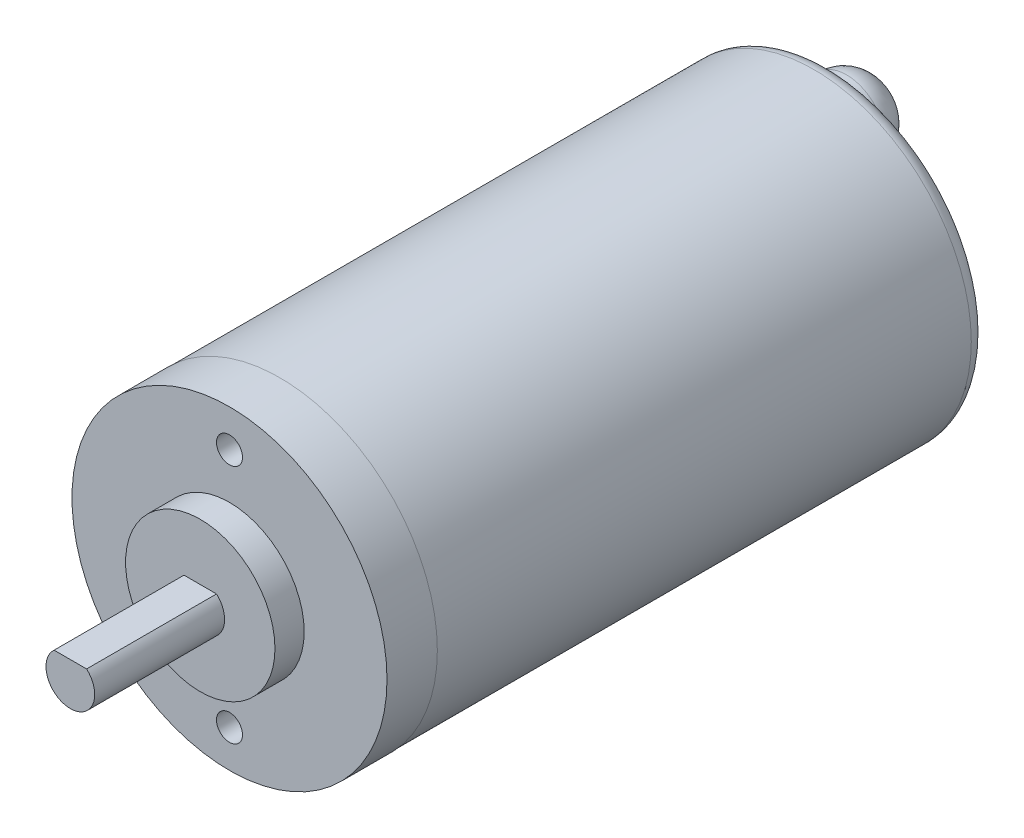
ISO-10303-21;
HEADER;
FILE_DESCRIPTION(('STEP AP214'),'2;1');
FILE_NAME('part.step','',(''),(''),'','','');
FILE_SCHEMA(('AUTOMOTIVE_DESIGN { 1 0 10303 214 1 1 1 1 }'));
ENDSEC;
DATA;
#1=APPLICATION_CONTEXT('core data for automotive mechanical design processes');
#2=APPLICATION_PROTOCOL_DEFINITION('international standard','automotive_design',2000,#1);
#3=PRODUCT_CONTEXT('',#1,'mechanical');
#4=PRODUCT('Part','Part','',(#3));
#5=PRODUCT_RELATED_PRODUCT_CATEGORY('part','',(#4));
#6=PRODUCT_DEFINITION_FORMATION('','',#4);
#7=PRODUCT_DEFINITION_CONTEXT('part definition',#1,'design');
#8=PRODUCT_DEFINITION('design','',#6,#7);
#9=PRODUCT_DEFINITION_SHAPE('','',#8);
#10=(LENGTH_UNIT() NAMED_UNIT(*) SI_UNIT(.MILLI.,.METRE.));
#11=(NAMED_UNIT(*) PLANE_ANGLE_UNIT() SI_UNIT($,.RADIAN.));
#12=(NAMED_UNIT(*) SI_UNIT($,.STERADIAN.) SOLID_ANGLE_UNIT());
#13=UNCERTAINTY_MEASURE_WITH_UNIT(LENGTH_MEASURE(1.E-05),#10,'distance_accuracy_value','');
#14=(GEOMETRIC_REPRESENTATION_CONTEXT(3) GLOBAL_UNCERTAINTY_ASSIGNED_CONTEXT((#13)) GLOBAL_UNIT_ASSIGNED_CONTEXT((#10,
#11,#12)) REPRESENTATION_CONTEXT('',''));
#15=CARTESIAN_POINT('',(0.,0.,0.));
#16=DIRECTION('',(0.,0.,1.));
#17=DIRECTION('',(1.,0.,0.));
#18=AXIS2_PLACEMENT_3D('',#15,#16,#17);
#19=CARTESIAN_POINT('',(0.,0.,-46.99));
#20=DIRECTION('',(0.,0.,1.));
#21=DIRECTION('',(1.,0.,0.));
#22=AXIS2_PLACEMENT_3D('',#19,#20,#21);
#23=CYLINDRICAL_SURFACE('',#22,12.319);
#24=CARTESIAN_POINT('',(0.,0.,-3.937));
#25=DIRECTION('',(0.,0.,-1.));
#26=DIRECTION('',(-1.,0.,0.));
#27=AXIS2_PLACEMENT_3D('',#24,#25,#26);
#28=CIRCLE('',#27,12.319);
#29=CARTESIAN_POINT('',(-12.319,0.,-3.937));
#30=VERTEX_POINT('',#29);
#31=EDGE_CURVE('E79',#30,#30,#28,.T.);
#32=ORIENTED_EDGE('',*,*,#31,.F.);
#33=EDGE_LOOP('',(#32));
#34=FACE_BOUND('',#33,.T.);
#35=CARTESIAN_POINT('',(0.,0.,0.));
#36=DIRECTION('',(0.,0.,1.));
#37=DIRECTION('',(1.,0.,0.));
#38=AXIS2_PLACEMENT_3D('',#35,#36,#37);
#39=CIRCLE('',#38,12.319);
#40=CARTESIAN_POINT('',(12.319,0.,0.));
#41=VERTEX_POINT('',#40);
#42=EDGE_CURVE('E85',#41,#41,#39,.T.);
#43=ORIENTED_EDGE('',*,*,#42,.F.);
#44=EDGE_LOOP('',(#43));
#45=FACE_BOUND('',#44,.T.);
#46=ADVANCED_FACE('F35',(#34,#45),#23,.T.);
#47=CARTESIAN_POINT('',(0.,0.,0.));
#48=DIRECTION('',(0.,0.,1.));
#49=DIRECTION('',(1.,0.,0.));
#50=AXIS2_PLACEMENT_3D('',#47,#48,#49);
#51=PLANE('',#50);
#52=CARTESIAN_POINT('',(0.,-9.398,0.));
#53=DIRECTION('',(0.,0.,-1.));
#54=DIRECTION('',(1.,0.,0.));
#55=AXIS2_PLACEMENT_3D('',#52,#53,#54);
#56=CIRCLE('',#55,1.016);
#57=CARTESIAN_POINT('',(1.016,-9.398,0.));
#58=VERTEX_POINT('',#57);
#59=EDGE_CURVE('E167',#58,#58,#56,.T.);
#60=ORIENTED_EDGE('',*,*,#59,.T.);
#61=EDGE_LOOP('',(#60));
#62=FACE_BOUND('',#61,.T.);
#63=CARTESIAN_POINT('',(0.,9.398,0.));
#64=DIRECTION('',(0.,0.,1.));
#65=DIRECTION('',(1.,0.,0.));
#66=AXIS2_PLACEMENT_3D('',#63,#64,#65);
#67=CIRCLE('',#66,1.016);
#68=CARTESIAN_POINT('',(1.016,9.398,0.));
#69=VERTEX_POINT('',#68);
#70=EDGE_CURVE('E161',#69,#69,#67,.T.);
#71=ORIENTED_EDGE('',*,*,#70,.F.);
#72=EDGE_LOOP('',(#71));
#73=FACE_BOUND('',#72,.T.);
#74=CARTESIAN_POINT('',(0.,0.,0.));
#75=DIRECTION('',(0.,0.,1.));
#76=DIRECTION('',(1.,0.,0.));
#77=AXIS2_PLACEMENT_3D('',#74,#75,#76);
#78=CIRCLE('',#77,5.842);
#79=CARTESIAN_POINT('',(5.842,0.,0.));
#80=VERTEX_POINT('',#79);
#81=EDGE_CURVE('E76',#80,#80,#78,.T.);
#82=ORIENTED_EDGE('',*,*,#81,.F.);
#83=EDGE_LOOP('',(#82));
#84=FACE_BOUND('',#83,.T.);
#85=ORIENTED_EDGE('',*,*,#42,.T.);
#86=EDGE_LOOP('',(#85));
#87=FACE_BOUND('',#86,.T.);
#88=ADVANCED_FACE('F122',(#62,#73,#84,#87),#51,.T.);
#89=CARTESIAN_POINT('',(0.,0.,2.286));
#90=DIRECTION('',(0.,0.,-1.));
#91=DIRECTION('',(-1.,0.,0.));
#92=AXIS2_PLACEMENT_3D('',#89,#90,#91);
#93=CYLINDRICAL_SURFACE('',#92,5.842);
#94=CARTESIAN_POINT('',(0.,0.,2.286));
#95=DIRECTION('',(0.,0.,1.));
#96=DIRECTION('',(1.,0.,0.));
#97=AXIS2_PLACEMENT_3D('',#94,#95,#96);
#98=CIRCLE('',#97,5.842);
#99=CARTESIAN_POINT('',(5.842,0.,2.286));
#100=VERTEX_POINT('',#99);
#101=EDGE_CURVE('E82',#100,#100,#98,.T.);
#102=ORIENTED_EDGE('',*,*,#101,.F.);
#103=EDGE_LOOP('',(#102));
#104=FACE_BOUND('',#103,.T.);
#105=ORIENTED_EDGE('',*,*,#81,.T.);
#106=EDGE_LOOP('',(#105));
#107=FACE_BOUND('',#106,.T.);
#108=ADVANCED_FACE('F128',(#104,#107),#93,.T.);
#109=CARTESIAN_POINT('',(0.,0.,2.286));
#110=DIRECTION('',(0.,0.,1.));
#111=DIRECTION('',(1.,0.,0.));
#112=AXIS2_PLACEMENT_3D('',#109,#110,#111);
#113=PLANE('',#112);
#114=CARTESIAN_POINT('',(0.,0.,2.286));
#115=DIRECTION('',(0.,0.,1.));
#116=DIRECTION('',(1.,0.,0.));
#117=AXIS2_PLACEMENT_3D('',#114,#115,#116);
#118=CIRCLE('',#117,1.905);
#119=CARTESIAN_POINT('',(-1.27205208190772,1.41806505524755,2.286));
#120=VERTEX_POINT('',#119);
#121=CARTESIAN_POINT('',(1.27205208190772,1.41806505524755,2.286));
#122=VERTEX_POINT('',#121);
#123=EDGE_CURVE('E70',#120,#122,#118,.T.);
#124=ORIENTED_EDGE('',*,*,#123,.F.);
#125=DIRECTION('',(-1.,0.,0.));
#126=VECTOR('',#125,1.);
#127=CARTESIAN_POINT('',(-1.49562694866086,1.41806505524755,2.286));
#128=LINE('',#127,#126);
#129=EDGE_CURVE('E60',#122,#120,#128,.T.);
#130=ORIENTED_EDGE('',*,*,#129,.F.);
#131=EDGE_LOOP('',(#124,#130));
#132=FACE_BOUND('',#131,.T.);
#133=ORIENTED_EDGE('',*,*,#101,.T.);
#134=EDGE_LOOP('',(#133));
#135=FACE_BOUND('',#134,.T.);
#136=ADVANCED_FACE('F68',(#132,#135),#113,.T.);
#137=CARTESIAN_POINT('',(0.,0.,12.446));
#138=DIRECTION('',(0.,0.,-1.));
#139=DIRECTION('',(-1.,0.,0.));
#140=AXIS2_PLACEMENT_3D('',#137,#138,#139);
#141=CYLINDRICAL_SURFACE('',#140,1.905);
#142=CARTESIAN_POINT('',(0.,0.,12.446));
#143=DIRECTION('',(0.,0.,1.));
#144=DIRECTION('',(1.,0.,0.));
#145=AXIS2_PLACEMENT_3D('',#142,#143,#144);
#146=CIRCLE('',#145,1.905);
#147=CARTESIAN_POINT('',(-1.27205208190772,1.41806505524755,12.446));
#148=VERTEX_POINT('',#147);
#149=CARTESIAN_POINT('',(1.27205208190772,1.41806505524755,12.446));
#150=VERTEX_POINT('',#149);
#151=EDGE_CURVE('E73',#148,#150,#146,.T.);
#152=ORIENTED_EDGE('',*,*,#151,.F.);
#153=DIRECTION('',(0.,0.,-1.));
#154=VECTOR('',#153,1.);
#155=CARTESIAN_POINT('',(-1.27205208190772,1.41806505524755,12.446));
#156=LINE('',#155,#154);
#157=EDGE_CURVE('E49',#148,#120,#156,.T.);
#158=ORIENTED_EDGE('',*,*,#157,.T.);
#159=ORIENTED_EDGE('',*,*,#123,.T.);
#160=DIRECTION('',(0.,0.,-1.));
#161=VECTOR('',#160,1.);
#162=CARTESIAN_POINT('',(1.27205208190772,1.41806505524755,12.446));
#163=LINE('',#162,#161);
#164=EDGE_CURVE('E57',#122,#150,#163,.F.);
#165=ORIENTED_EDGE('',*,*,#164,.T.);
#166=EDGE_LOOP('',(#152,#158,#159,#165));
#167=FACE_BOUND('',#166,.T.);
#168=ADVANCED_FACE('F72',(#167),#141,.T.);
#169=CARTESIAN_POINT('',(0.,0.,12.446));
#170=DIRECTION('',(0.,0.,1.));
#171=DIRECTION('',(1.,0.,0.));
#172=AXIS2_PLACEMENT_3D('',#169,#170,#171);
#173=PLANE('',#172);
#174=DIRECTION('',(1.,0.,0.));
#175=VECTOR('',#174,1.);
#176=CARTESIAN_POINT('',(0.,1.41806505524755,12.446));
#177=LINE('',#176,#175);
#178=EDGE_CURVE('E11',#148,#150,#177,.T.);
#179=ORIENTED_EDGE('',*,*,#178,.F.);
#180=ORIENTED_EDGE('',*,*,#151,.T.);
#181=EDGE_LOOP('',(#179,#180));
#182=FACE_BOUND('',#181,.T.);
#183=ADVANCED_FACE('F155',(#182),#173,.T.);
#184=CARTESIAN_POINT('',(0.,12.319,-3.937));
#185=DIRECTION('',(0.,0.,1.));
#186=DIRECTION('',(1.,0.,0.));
#187=AXIS2_PLACEMENT_3D('',#184,#185,#186);
#188=PLANE('',#187);
#189=CARTESIAN_POINT('',(0.,0.,-3.937));
#190=DIRECTION('',(0.,0.,-1.));
#191=DIRECTION('',(-1.,0.,0.));
#192=AXIS2_PLACEMENT_3D('',#189,#190,#191);
#193=CIRCLE('',#192,12.2936);
#194=CARTESIAN_POINT('',(-12.2936,0.,-3.937));
#195=VERTEX_POINT('',#194);
#196=EDGE_CURVE('E74',#195,#195,#193,.T.);
#197=ORIENTED_EDGE('',*,*,#196,.F.);
#198=EDGE_LOOP('',(#197));
#199=FACE_BOUND('',#198,.T.);
#200=ORIENTED_EDGE('',*,*,#31,.T.);
#201=EDGE_LOOP('',(#200));
#202=FACE_BOUND('',#201,.T.);
#203=ADVANCED_FACE('F149',(#199,#202),#188,.F.);
#204=CARTESIAN_POINT('',(0.,0.,-46.99));
#205=DIRECTION('',(0.,0.,-1.));
#206=DIRECTION('',(-1.,0.,0.));
#207=AXIS2_PLACEMENT_3D('',#204,#205,#206);
#208=CYLINDRICAL_SURFACE('',#207,12.2936);
#209=CARTESIAN_POINT('',(0.,0.,-45.72));
#210=DIRECTION('',(0.,0.,1.));
#211=DIRECTION('',(1.,0.,0.));
#212=AXIS2_PLACEMENT_3D('',#209,#210,#211);
#213=CIRCLE('',#212,12.2936);
#214=CARTESIAN_POINT('',(12.2936,0.,-45.72));
#215=VERTEX_POINT('',#214);
#216=EDGE_CURVE('E93',#215,#215,#213,.T.);
#217=ORIENTED_EDGE('',*,*,#216,.T.);
#218=EDGE_LOOP('',(#217));
#219=FACE_BOUND('',#218,.T.);
#220=ORIENTED_EDGE('',*,*,#196,.T.);
#221=EDGE_LOOP('',(#220));
#222=FACE_BOUND('',#221,.T.);
#223=ADVANCED_FACE('F140',(#219,#222),#208,.T.);
#224=CARTESIAN_POINT('',(0.,0.,-46.99));
#225=DIRECTION('',(0.,0.,1.));
#226=DIRECTION('',(1.,0.,0.));
#227=AXIS2_PLACEMENT_3D('',#224,#225,#226);
#228=PLANE('',#227);
#229=CARTESIAN_POINT('',(0.,7.62,-46.99));
#230=DIRECTION('',(0.,0.,1.));
#231=DIRECTION('',(1.,0.,0.));
#232=AXIS2_PLACEMENT_3D('',#229,#230,#231);
#233=CIRCLE('',#232,3.048);
#234=CARTESIAN_POINT('',(3.048,7.62,-46.99));
#235=VERTEX_POINT('',#234);
#236=EDGE_CURVE('E96',#235,#235,#233,.F.);
#237=ORIENTED_EDGE('',*,*,#236,.F.);
#238=EDGE_LOOP('',(#237));
#239=FACE_BOUND('',#238,.T.);
#240=CARTESIAN_POINT('',(0.,0.,-46.99));
#241=DIRECTION('',(0.,0.,1.));
#242=DIRECTION('',(1.,0.,0.));
#243=AXIS2_PLACEMENT_3D('',#240,#241,#242);
#244=CIRCLE('',#243,11.0236);
#245=CARTESIAN_POINT('',(11.0236,0.,-46.99));
#246=VERTEX_POINT('',#245);
#247=EDGE_CURVE('E90',#246,#246,#244,.F.);
#248=ORIENTED_EDGE('',*,*,#247,.T.);
#249=EDGE_LOOP('',(#248));
#250=FACE_BOUND('',#249,.T.);
#251=ADVANCED_FACE('F135',(#239,#250),#228,.F.);
#252=CARTESIAN_POINT('',(0.,0.,-45.72));
#253=DIRECTION('',(0.,0.,1.));
#254=DIRECTION('',(1.,0.,0.));
#255=AXIS2_PLACEMENT_3D('',#252,#253,#254);
#256=TOROIDAL_SURFACE('',#255,11.0236,1.27);
#257=ORIENTED_EDGE('',*,*,#216,.F.);
#258=EDGE_LOOP('',(#257));
#259=FACE_BOUND('',#258,.T.);
#260=ORIENTED_EDGE('',*,*,#247,.F.);
#261=EDGE_LOOP('',(#260));
#262=FACE_BOUND('',#261,.T.);
#263=ADVANCED_FACE('F118',(#259,#262),#256,.T.);
#264=CARTESIAN_POINT('',(0.,7.62,-50.8));
#265=DIRECTION('',(0.,0.,1.));
#266=DIRECTION('',(1.,0.,0.));
#267=AXIS2_PLACEMENT_3D('',#264,#265,#266);
#268=CYLINDRICAL_SURFACE('',#267,3.048);
#269=CARTESIAN_POINT('',(0.,7.62,-48.26));
#270=DIRECTION('',(0.,0.,-1.));
#271=DIRECTION('',(-1.,0.,0.));
#272=AXIS2_PLACEMENT_3D('',#269,#270,#271);
#273=CIRCLE('',#272,3.048);
#274=CARTESIAN_POINT('',(-3.048,7.62,-48.26));
#275=VERTEX_POINT('',#274);
#276=EDGE_CURVE('E43',#275,#275,#273,.F.);
#277=ORIENTED_EDGE('',*,*,#276,.T.);
#278=EDGE_LOOP('',(#277));
#279=FACE_BOUND('',#278,.T.);
#280=ORIENTED_EDGE('',*,*,#236,.T.);
#281=EDGE_LOOP('',(#280));
#282=FACE_BOUND('',#281,.T.);
#283=ADVANCED_FACE('F104',(#279,#282),#268,.T.);
#284=CARTESIAN_POINT('',(0.,7.62,-50.8));
#285=DIRECTION('',(0.,0.,-1.));
#286=DIRECTION('',(-1.,0.,0.));
#287=AXIS2_PLACEMENT_3D('',#284,#285,#286);
#288=PLANE('',#287);
#289=CARTESIAN_POINT('',(0.,7.62,-50.8));
#290=DIRECTION('',(0.,0.,-1.));
#291=DIRECTION('',(-1.,0.,0.));
#292=AXIS2_PLACEMENT_3D('',#289,#290,#291);
#293=CIRCLE('',#292,0.508);
#294=CARTESIAN_POINT('',(-0.508,7.62,-50.8));
#295=VERTEX_POINT('',#294);
#296=EDGE_CURVE('E99',#295,#295,#293,.T.);
#297=ORIENTED_EDGE('',*,*,#296,.T.);
#298=EDGE_LOOP('',(#297));
#299=FACE_BOUND('',#298,.T.);
#300=ADVANCED_FACE('F110',(#299),#288,.T.);
#301=CARTESIAN_POINT('',(0.,7.62,-48.26));
#302=DIRECTION('',(0.,0.,-1.));
#303=DIRECTION('',(-1.,0.,0.));
#304=AXIS2_PLACEMENT_3D('',#301,#302,#303);
#305=DEGENERATE_TOROIDAL_SURFACE('',#304,0.508,2.54,.T.);
#306=ORIENTED_EDGE('',*,*,#276,.F.);
#307=EDGE_LOOP('',(#306));
#308=FACE_BOUND('',#307,.T.);
#309=ORIENTED_EDGE('',*,*,#296,.F.);
#310=EDGE_LOOP('',(#309));
#311=FACE_BOUND('',#310,.T.);
#312=ADVANCED_FACE('F37',(#308,#311),#305,.T.);
#313=CARTESIAN_POINT('',(0.,9.398,-6.35));
#314=DIRECTION('',(0.,0.,1.));
#315=DIRECTION('',(1.,0.,0.));
#316=AXIS2_PLACEMENT_3D('',#313,#314,#315);
#317=CYLINDRICAL_SURFACE('',#316,1.016);
#318=CARTESIAN_POINT('',(0.,9.398,-6.35));
#319=DIRECTION('',(0.,0.,1.));
#320=DIRECTION('',(1.,0.,0.));
#321=AXIS2_PLACEMENT_3D('',#318,#319,#320);
#322=CIRCLE('',#321,1.016);
#323=CARTESIAN_POINT('',(1.016,9.398,-6.35));
#324=VERTEX_POINT('',#323);
#325=EDGE_CURVE('E158',#324,#324,#322,.T.);
#326=ORIENTED_EDGE('',*,*,#325,.F.);
#327=EDGE_LOOP('',(#326));
#328=FACE_BOUND('',#327,.T.);
#329=ORIENTED_EDGE('',*,*,#70,.T.);
#330=EDGE_LOOP('',(#329));
#331=FACE_BOUND('',#330,.T.);
#332=ADVANCED_FACE('F109',(#328,#331),#317,.F.);
#333=CARTESIAN_POINT('',(0.,9.398,-6.35));
#334=DIRECTION('',(0.,0.,1.));
#335=DIRECTION('',(1.,0.,0.));
#336=AXIS2_PLACEMENT_3D('',#333,#334,#335);
#337=PLANE('',#336);
#338=ORIENTED_EDGE('',*,*,#325,.T.);
#339=EDGE_LOOP('',(#338));
#340=FACE_BOUND('',#339,.T.);
#341=ADVANCED_FACE('F186',(#340),#337,.T.);
#342=CARTESIAN_POINT('',(0.,-9.398,-6.35));
#343=DIRECTION('',(0.,0.,1.));
#344=DIRECTION('',(1.,0.,0.));
#345=AXIS2_PLACEMENT_3D('',#342,#343,#344);
#346=CYLINDRICAL_SURFACE('',#345,1.016);
#347=CARTESIAN_POINT('',(0.,-9.398,-6.35));
#348=DIRECTION('',(0.,0.,-1.));
#349=DIRECTION('',(1.,0.,0.));
#350=AXIS2_PLACEMENT_3D('',#347,#348,#349);
#351=CIRCLE('',#350,1.016);
#352=CARTESIAN_POINT('',(1.016,-9.398,-6.35));
#353=VERTEX_POINT('',#352);
#354=EDGE_CURVE('E165',#353,#353,#351,.T.);
#355=ORIENTED_EDGE('',*,*,#354,.T.);
#356=EDGE_LOOP('',(#355));
#357=FACE_BOUND('',#356,.T.);
#358=ORIENTED_EDGE('',*,*,#59,.F.);
#359=EDGE_LOOP('',(#358));
#360=FACE_BOUND('',#359,.T.);
#361=ADVANCED_FACE('F174',(#357,#360),#346,.F.);
#362=CARTESIAN_POINT('',(0.,-9.398,-6.35));
#363=DIRECTION('',(0.,0.,1.));
#364=DIRECTION('',(1.,0.,0.));
#365=AXIS2_PLACEMENT_3D('',#362,#363,#364);
#366=PLANE('',#365);
#367=ORIENTED_EDGE('',*,*,#354,.F.);
#368=EDGE_LOOP('',(#367));
#369=FACE_BOUND('',#368,.T.);
#370=ADVANCED_FACE('F177',(#369),#366,.T.);
#371=CARTESIAN_POINT('',(-1.49562694866086,1.41806505524755,-0.748083696644242));
#372=DIRECTION('',(0.,-1.,0.));
#373=DIRECTION('',(0.,0.,-1.));
#374=AXIS2_PLACEMENT_3D('',#371,#372,#373);
#375=PLANE('',#374);
#376=ORIENTED_EDGE('',*,*,#178,.T.);
#377=ORIENTED_EDGE('',*,*,#164,.F.);
#378=ORIENTED_EDGE('',*,*,#129,.T.);
#379=ORIENTED_EDGE('',*,*,#157,.F.);
#380=EDGE_LOOP('',(#376,#377,#378,#379));
#381=FACE_BOUND('',#380,.T.);
#382=ADVANCED_FACE('F59',(#381),#375,.F.);
#383=CLOSED_SHELL('',(#46,#88,#108,#136,#168,#183,#203,#223,#251,#263,#283,#300,#312,#332,#341,
#361,#370,#382));
#384=MANIFOLD_SOLID_BREP('B2',#383);
#385=ADVANCED_BREP_SHAPE_REPRESENTATION('',(#18,#384),#14);
#386=SHAPE_DEFINITION_REPRESENTATION(#9,#385);
ENDSEC;
END-ISO-10303-21;
